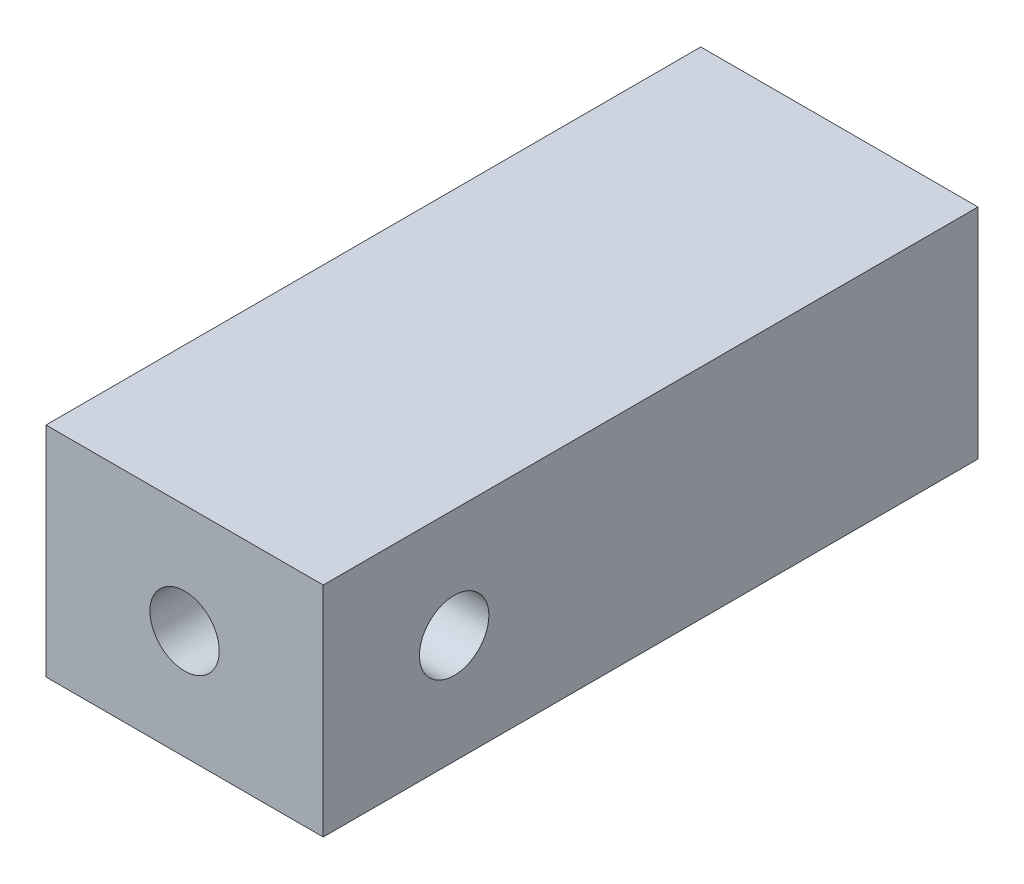
ISO-10303-21;
HEADER;
FILE_DESCRIPTION(('STEP AP214'),'2;1');
FILE_NAME('part.step','',(''),(''),'','','');
FILE_SCHEMA(('AUTOMOTIVE_DESIGN { 1 0 10303 214 1 1 1 1 }'));
ENDSEC;
DATA;
#1=APPLICATION_CONTEXT('core data for automotive mechanical design processes');
#2=APPLICATION_PROTOCOL_DEFINITION('international standard','automotive_design',2000,#1);
#3=PRODUCT_CONTEXT('',#1,'mechanical');
#4=PRODUCT('Part','Part','',(#3));
#5=PRODUCT_RELATED_PRODUCT_CATEGORY('part','',(#4));
#6=PRODUCT_DEFINITION_FORMATION('','',#4);
#7=PRODUCT_DEFINITION_CONTEXT('part definition',#1,'design');
#8=PRODUCT_DEFINITION('design','',#6,#7);
#9=PRODUCT_DEFINITION_SHAPE('','',#8);
#10=(LENGTH_UNIT() NAMED_UNIT(*) SI_UNIT(.MILLI.,.METRE.));
#11=(NAMED_UNIT(*) PLANE_ANGLE_UNIT() SI_UNIT($,.RADIAN.));
#12=(NAMED_UNIT(*) SI_UNIT($,.STERADIAN.) SOLID_ANGLE_UNIT());
#13=UNCERTAINTY_MEASURE_WITH_UNIT(LENGTH_MEASURE(1.E-05),#10,'distance_accuracy_value','');
#14=(GEOMETRIC_REPRESENTATION_CONTEXT(3) GLOBAL_UNCERTAINTY_ASSIGNED_CONTEXT((#13)) GLOBAL_UNIT_ASSIGNED_CONTEXT((#10,
#11,#12)) REPRESENTATION_CONTEXT('',''));
#15=CARTESIAN_POINT('',(0.,0.,0.));
#16=DIRECTION('',(0.,0.,1.));
#17=DIRECTION('',(1.,0.,0.));
#18=AXIS2_PLACEMENT_3D('',#15,#16,#17);
#19=CARTESIAN_POINT('',(6.35,-5.,30.));
#20=DIRECTION('',(0.,0.,-1.));
#21=DIRECTION('',(-1.,0.,0.));
#22=AXIS2_PLACEMENT_3D('',#19,#20,#21);
#23=CYLINDRICAL_SURFACE('',#22,1.5875);
#24=CARTESIAN_POINT('',(6.35,-5.,30.));
#25=DIRECTION('',(0.,0.,1.));
#26=DIRECTION('',(1.,0.,0.));
#27=AXIS2_PLACEMENT_3D('',#24,#25,#26);
#28=CIRCLE('',#27,1.5875);
#29=CARTESIAN_POINT('',(7.9375,-5.,30.));
#30=VERTEX_POINT('',#29);
#31=EDGE_CURVE('E109',#30,#30,#28,.T.);
#32=ORIENTED_EDGE('',*,*,#31,.T.);
#33=EDGE_LOOP('',(#32));
#34=FACE_BOUND('',#33,.T.);
#35=CARTESIAN_POINT('',(4.7625,-5.,25.59));
#36=CARTESIAN_POINT('',(4.76250389703763,-4.92915095463068,25.5899961041174));
#37=CARTESIAN_POINT('',(4.76728292998993,-4.8582724745346,25.5852245222981));
#38=CARTESIAN_POINT('',(4.78598948460399,-4.71896218896479,25.5665479150457));
#39=CARTESIAN_POINT('',(4.79992534555615,-4.65053267376699,25.5526345640368));
#40=CARTESIAN_POINT('',(4.83573406979614,-4.51853897435407,25.5168862810767));
#41=CARTESIAN_POINT('',(4.85755390135628,-4.45494564000333,25.4951042780132));
#42=CARTESIAN_POINT('',(4.90779541217916,-4.33325802593571,25.444955185947));
#43=CARTESIAN_POINT('',(4.93621961103376,-4.2751658568705,25.4165855837522));
#44=CARTESIAN_POINT('',(5.01109232259305,-4.1424303352103,25.3418679580117));
#45=CARTESIAN_POINT('',(5.06015826050958,-4.07073343195065,25.2929121462295));
#46=CARTESIAN_POINT('',(5.16581810092278,-3.93933386298857,25.1875249039839));
#47=CARTESIAN_POINT('',(5.22243059872736,-3.87966177019214,25.1310750089729));
#48=CARTESIAN_POINT('',(5.3638475045652,-3.75099943189347,24.9901493450863));
#49=CARTESIAN_POINT('',(5.45108806700432,-3.68732903691505,24.9032773129519));
#50=CARTESIAN_POINT('',(5.63159195837188,-3.58047384575442,24.7238363647634));
#51=CARTESIAN_POINT('',(5.72485213848059,-3.53727843635106,24.631270428323));
#52=CARTESIAN_POINT('',(5.87874884760696,-3.48278192091248,24.4795076017762));
#53=CARTESIAN_POINT('',(5.93819228697424,-3.46560182660029,24.4211162235734));
#54=CARTESIAN_POINT('',(6.04414793188666,-3.44153429900365,24.3183497685898));
#55=CARTESIAN_POINT('',(6.09032500204818,-3.43316429591458,24.2739873195653));
#56=CARTESIAN_POINT('',(6.16694912072186,-3.4228055111682,24.2032463051671));
#57=CARTESIAN_POINT('',(6.19679543375644,-3.41960077192013,24.1763669792003));
#58=CARTESIAN_POINT('',(6.24632844484815,-3.41578165501934,24.1362414072852));
#59=CARTESIAN_POINT('',(6.26503985662945,-3.41464449463582,24.1219972643188));
#60=CARTESIAN_POINT('',(6.29139356069688,-3.41357072498031,24.106568084902));
#61=CARTESIAN_POINT('',(6.29767280763601,-3.41334946859378,24.1031953775844));
#62=CARTESIAN_POINT('',(6.31061053140759,-3.4129755237362,24.0972714585057));
#63=CARTESIAN_POINT('',(6.31726794386282,-3.41282265261238,24.0947180636387));
#64=CARTESIAN_POINT('',(6.32924382424091,-3.41262745018344,24.0913815762441));
#65=CARTESIAN_POINT('',(6.33447964678338,-3.41256701631529,24.0903151762636));
#66=CARTESIAN_POINT('',(6.3450523130851,-3.41249895916934,24.0891115410369));
#67=CARTESIAN_POINT('',(6.35038889709763,-3.41249121487267,24.0889721765666));
#68=CARTESIAN_POINT('',(6.3609913844419,-3.41252918062127,24.0896461627449));
#69=CARTESIAN_POINT('',(6.36625735836957,-3.41257483250607,24.0904584768029));
#70=CARTESIAN_POINT('',(6.37660736872048,-3.41271453254082,24.0928783459675));
#71=CARTESIAN_POINT('',(6.38169089043472,-3.41280870760875,24.0944879861439));
#72=CARTESIAN_POINT('',(6.3995585626366,-3.41322093162997,24.1012651123531));
#73=CARTESIAN_POINT('',(6.41170607871695,-3.41365659664847,24.1080148901173));
#74=CARTESIAN_POINT('',(6.43512272603368,-3.41474029133559,24.1229261419796));
#75=CARTESIAN_POINT('',(6.44638173177858,-3.41539042409585,24.1311012022732));
#76=CARTESIAN_POINT('',(6.48215667628322,-3.41781498959904,24.1585835372783));
#77=CARTESIAN_POINT('',(6.50573114303392,-3.41998163401508,24.179082233108));
#78=CARTESIAN_POINT('',(6.55217165871214,-3.42525521262572,24.2207545975411));
#79=CARTESIAN_POINT('',(6.57503632429614,-3.42836386966622,24.2419294387249));
#80=CARTESIAN_POINT('',(6.62028726693252,-3.435511206545,24.284492907049));
#81=CARTESIAN_POINT('',(6.64267490128022,-3.43954670281683,24.3058805679654));
#82=CARTESIAN_POINT('',(6.68717462847129,-3.44855442806553,24.3487074141555));
#83=CARTESIAN_POINT('',(6.70928689228526,-3.45352604138479,24.3701465564739));
#84=CARTESIAN_POINT('',(6.78608550009062,-3.47252655686299,24.4449163613746));
#85=CARTESIAN_POINT('',(6.84024233962711,-3.48901792855836,24.4981938475657));
#86=CARTESIAN_POINT('',(6.94730576592902,-3.52805329026723,24.6038659957627));
#87=CARTESIAN_POINT('',(7.00021131693618,-3.55060211585807,24.6562599167633));
#88=CARTESIAN_POINT('',(7.10442268177438,-3.60200814402343,24.7596396798864));
#89=CARTESIAN_POINT('',(7.15572728070053,-3.63087001040755,24.8106244494554));
#90=CARTESIAN_POINT('',(7.25614320717116,-3.69515832935082,24.9105017991057));
#91=CARTESIAN_POINT('',(7.30525605966303,-3.73058012647956,24.9593958328317));
#92=CARTESIAN_POINT('',(7.41380317841809,-3.81904978547134,25.067516517824));
#93=CARTESIAN_POINT('',(7.47235944615251,-3.87426579346885,25.1258848173238));
#94=CARTESIAN_POINT('',(7.58285819765357,-3.99651488621904,25.2360688545125));
#95=CARTESIAN_POINT('',(7.63481296426858,-4.06352545457417,25.2878967600874));
#96=CARTESIAN_POINT('',(7.71959750298707,-4.19433221202803,25.3724922096134));
#97=CARTESIAN_POINT('',(7.754155898931,-4.25588212986962,25.4069804147871));
#98=CARTESIAN_POINT('',(7.81576421751242,-4.38611066696606,25.4684702416124));
#99=CARTESIAN_POINT('',(7.84282247543135,-4.45478125504101,25.4954801742071));
#100=CARTESIAN_POINT('',(7.8840986770727,-4.58682976384966,25.5366851604994));
#101=CARTESIAN_POINT('',(7.89966041758163,-4.64936511114957,25.5522212210114));
#102=CARTESIAN_POINT('',(7.92313538051704,-4.77724896820915,25.575658028009));
#103=CARTESIAN_POINT('',(7.93105316643102,-4.84259577513695,25.5835633301035));
#104=CARTESIAN_POINT('',(7.93866966368224,-4.974422795267,25.5911678112274));
#105=CARTESIAN_POINT('',(7.93834705046067,-5.04090550410264,25.5908456993009));
#106=CARTESIAN_POINT('',(7.92945561352854,-5.17275610471175,25.5819683069074));
#107=CARTESIAN_POINT('',(7.92088531653321,-5.23812379518618,25.5734115554857));
#108=CARTESIAN_POINT('',(7.89658340350374,-5.36355629632184,25.5491492876934));
#109=CARTESIAN_POINT('',(7.88112202006543,-5.42372739329241,25.533713532124));
#110=CARTESIAN_POINT('',(7.84404260456592,-5.54012114191816,25.4966983220834));
#111=CARTESIAN_POINT('',(7.82242227643246,-5.59634231126625,25.4751165763705));
#112=CARTESIAN_POINT('',(7.76415357324816,-5.72611043252649,25.4169578966849));
#113=CARTESIAN_POINT('',(7.72497076749532,-5.79738938522647,25.3778535146799));
#114=CARTESIAN_POINT('',(7.63894914210549,-5.93008155127175,25.2920236892132));
#115=CARTESIAN_POINT('',(7.59209307089512,-5.99147190080864,25.2452810734599));
#116=CARTESIAN_POINT('',(7.47406206633548,-6.12577655790253,25.1275786779146));
#117=CARTESIAN_POINT('',(7.40038234852918,-6.19429799787781,25.0541363341209));
#118=CARTESIAN_POINT('',(7.2462766687811,-6.31391724261018,24.9006670632283));
#119=CARTESIAN_POINT('',(7.16584621111663,-6.36500331954824,24.8206357488269));
#120=CARTESIAN_POINT('',(7.02516490235041,-6.43825924650051,24.6809890060884));
#121=CARTESIAN_POINT('',(6.96600174427972,-6.46451165962647,24.6223561221985));
#122=CARTESIAN_POINT('',(6.84609171491893,-6.50935335647387,24.503932871894));
#123=CARTESIAN_POINT('',(6.78534689430675,-6.52795208412478,24.444144027828));
#124=CARTESIAN_POINT('',(6.67595215546088,-6.55445711664319,24.3377383050935));
#125=CARTESIAN_POINT('',(6.62761485242384,-6.56382116181605,24.2911474223788));
#126=CARTESIAN_POINT('',(6.54688426259295,-6.57557031647108,24.2157342244597));
#127=CARTESIAN_POINT('',(6.51503558337731,-6.57925450184842,24.1865700906555));
#128=CARTESIAN_POINT('',(6.46984714303711,-6.58301361758644,24.14922980039));
#129=CARTESIAN_POINT('',(6.45776926980213,-6.58388631147932,24.1396128115334));
#130=CARTESIAN_POINT('',(6.43284717171285,-6.58538653278594,24.1213654568353));
#131=CARTESIAN_POINT('',(6.4200048895595,-6.58601465347181,24.1127327398689));
#132=CARTESIAN_POINT('',(6.40068493010964,-6.58670076694983,24.1024244157426));
#133=CARTESIAN_POINT('',(6.39483701987773,-6.58687811379084,24.0996181229455));
#134=CARTESIAN_POINT('',(6.38281654443958,-6.58717212593333,24.094817152759));
#135=CARTESIAN_POINT('',(6.37664496738506,-6.58728896529905,24.0928201508955));
#136=CARTESIAN_POINT('',(6.36521291734318,-6.58743533486871,24.0902799251889));
#137=CARTESIAN_POINT('',(6.35999983699544,-6.58747716656613,24.0895336985998));
#138=CARTESIAN_POINT('',(6.34953103350799,-6.58750852833345,24.0889763646493));
#139=CARTESIAN_POINT('',(6.34427541354027,-6.58749816039454,24.0891634337448));
#140=CARTESIAN_POINT('',(6.33275100515763,-6.58741892939597,24.0905625702224));
#141=CARTESIAN_POINT('',(6.32650926475277,-6.58733788570576,24.0919878234316));
#142=CARTESIAN_POINT('',(6.31432209110947,-6.58711073893729,24.095831062238));
#143=CARTESIAN_POINT('',(6.30837858645921,-6.58696426123489,24.0982547578288));
#144=CARTESIAN_POINT('',(6.28049907987245,-6.58613412602315,24.1112492729268));
#145=CARTESIAN_POINT('',(6.26049984463202,-6.58509669565302,24.125592999797));
#146=CARTESIAN_POINT('',(6.22174065838665,-6.58242686910014,24.1558231799466));
#147=CARTESIAN_POINT('',(6.20299961486411,-6.58078710277025,24.1717268738095));
#148=CARTESIAN_POINT('',(6.14829686605957,-6.5750579236933,24.2197670932311));
#149=CARTESIAN_POINT('',(6.11312263339979,-6.57012983628092,24.2527940262501));
#150=CARTESIAN_POINT('',(6.04343969943363,-6.55801665434634,24.3191321916899));
#151=CARTESIAN_POINT('',(6.0089319928307,-6.55082842724322,24.3524437558927));
#152=CARTESIAN_POINT('',(5.9406404811646,-6.53421347590636,24.4188645958818));
#153=CARTESIAN_POINT('',(5.90685361292447,-6.52480016051365,24.451973909564));
#154=CARTESIAN_POINT('',(5.83977058619284,-6.5036812383225,24.5179232060884));
#155=CARTESIAN_POINT('',(5.80647427532257,-6.4919763601989,24.5507632710973));
#156=CARTESIAN_POINT('',(5.72307594319569,-6.45946699961953,24.6331787805833));
#157=CARTESIAN_POINT('',(5.67331311550503,-6.43710873167583,24.682503520289));
#158=CARTESIAN_POINT('',(5.57531984537415,-6.38674656366913,24.7797691241432));
#159=CARTESIAN_POINT('',(5.52709021305381,-6.35873973454896,24.8277092554988));
#160=CARTESIAN_POINT('',(5.38529147345793,-6.26580426408146,24.968767214804));
#161=CARTESIAN_POINT('',(5.29450541195571,-6.19192068042418,25.0592288449138));
#162=CARTESIAN_POINT('',(5.15932188446301,-6.05253436775264,25.1940037203534));
#163=CARTESIAN_POINT('',(5.11069215943519,-5.99510263047811,25.2425049164081));
#164=CARTESIAN_POINT('',(5.02019516199023,-5.87044959859834,25.3327843789538));
#165=CARTESIAN_POINT('',(4.97831590058573,-5.80324607202412,25.3745745638605));
#166=CARTESIAN_POINT('',(4.91040268104391,-5.67240155476057,25.4423524755451));
#167=CARTESIAN_POINT('',(4.88287275967468,-5.61031648762995,25.4698313292858));
#168=CARTESIAN_POINT('',(4.83542077259719,-5.48057837025857,25.5171987106552));
#169=CARTESIAN_POINT('',(4.81548895770586,-5.41293259148685,25.537096964983));
#170=CARTESIAN_POINT('',(4.78777549690456,-5.28782560684921,25.5647647333207));
#171=CARTESIAN_POINT('',(4.77834738918193,-5.23109030325961,25.5741777395298));
#172=CARTESIAN_POINT('',(4.76570830798837,-5.1162431929504,25.5867967055685));
#173=CARTESIAN_POINT('',(4.76249680248817,-5.05813150445546,25.5900031965641));
#174=CARTESIAN_POINT('',(4.7625,-5.,25.59));
#175=B_SPLINE_CURVE_WITH_KNOTS('',3,(#35,#36,#37,#38,#39,#40,#41,#42,#43,#44,#45,#46,#47,#48,
#49,#50,#51,#52,#53,#54,#55,#56,#57,#58,#59,#60,#61,#62,#63,#64,#65,#66,#67,#68,#69,#70,#71,#72,
#73,#74,#75,#76,#77,#78,#79,#80,#81,#82,#83,#84,#85,#86,#87,#88,#89,#90,#91,#92,#93,#94,#95,#96,
#97,#98,#99,#100,#101,#102,#103,#104,#105,#106,#107,#108,#109,#110,#111,#112,#113,#114,#115,
#116,#117,#118,#119,#120,#121,#122,#123,#124,#125,#126,#127,#128,#129,#130,#131,#132,#133,#134,
#135,#136,#137,#138,#139,#140,#141,#142,#143,#144,#145,#146,#147,#148,#149,#150,#151,#152,#153,
#154,#155,#156,#157,#158,#159,#160,#161,#162,#163,#164,#165,#166,#167,#168,#169,#170,#171,#172,
#173,#174),.UNSPECIFIED.,.T.,.F.,(4,2,2,2,2,2,2,2,2,2,2,2,2,2,2,2,2,2,2,2,2,2,2,2,2,2,2,2,2,2,2,
2,2,2,2,2,2,2,2,2,2,2,2,2,2,2,2,2,2,2,2,2,2,2,2,2,2,2,2,2,2,2,2,2,2,2,2,2,2,4),(0.,
0.212292256511526,0.424778119928417,0.635860517852925,0.847023577143529,1.14453982942337,
1.44280322491309,1.8564050835252,2.2697923162809,2.52477021052349,2.71831419584283,
2.8392194047191,2.90952794768359,2.93088745273038,2.95218956217326,2.96815232904023,
2.9840784197725,2.99998717954843,3.01593776336173,3.05730427624332,3.09908912960614,
3.19288089005881,3.28684523218849,3.38049152284374,3.4740764387586,3.7070282623813,
3.94016660352504,4.17347776272342,4.40662397653399,4.70391650697207,5.00064752818204,
5.23546971891959,5.47002988391914,5.66804141198609,5.86593465272642,6.06434005465023,
6.26278090433548,6.45404426495234,6.64537902262273,6.91463149386278,7.18449784451944,
7.55619729901187,7.92814628498145,8.18981072212397,8.45115131474451,8.65440522578264,
8.78427341310193,8.8306634521696,8.87694024916764,8.89637057070647,8.91574468135097,
8.93146888443177,8.94716237643337,8.96625420847888,8.98545677493515,9.05855802030898,
9.13258526151245,9.27786584121137,9.42334867582738,9.56797619980672,9.71255780936788,
9.93292429705593,10.1534053507879,10.5939045661397,10.8617010647503,11.1290165812034,
11.3479597336018,11.5666210052883,11.740821299509,11.9150066846603),.UNSPECIFIED.);
#176=CARTESIAN_POINT('',(4.7625,-5.,25.59));
#177=VERTEX_POINT('',#176);
#178=EDGE_CURVE('E37',#177,#177,#175,.T.);
#179=ORIENTED_EDGE('',*,*,#178,.T.);
#180=EDGE_LOOP('',(#179));
#181=FACE_BOUND('',#180,.T.);
#182=ADVANCED_FACE('F33',(#34,#181),#23,.F.);
#183=CARTESIAN_POINT('',(6.35,-5.,0.));
#184=DIRECTION('',(0.,0.,1.));
#185=DIRECTION('',(1.,0.,0.));
#186=AXIS2_PLACEMENT_3D('',#183,#184,#185);
#187=CIRCLE('',#186,1.5875);
#188=CARTESIAN_POINT('',(7.9375,-5.,0.));
#189=VERTEX_POINT('',#188);
#190=EDGE_CURVE('E149',#189,#189,#187,.T.);
#191=ORIENTED_EDGE('',*,*,#190,.F.);
#192=EDGE_LOOP('',(#191));
#193=FACE_BOUND('',#192,.T.);
#194=CARTESIAN_POINT('',(4.7625,-5.,22.41));
#195=CARTESIAN_POINT('',(4.76250389703763,-5.07084904536932,22.4100038958826));
#196=CARTESIAN_POINT('',(4.76728292998993,-5.1417275254654,22.4147754777019));
#197=CARTESIAN_POINT('',(4.78598948460399,-5.28103781103521,22.4334520849544));
#198=CARTESIAN_POINT('',(4.79992534555615,-5.34946732623301,22.4473654359632));
#199=CARTESIAN_POINT('',(4.83573406979614,-5.48146102564593,22.4831137189233));
#200=CARTESIAN_POINT('',(4.85755390135628,-5.54505435999667,22.5048957219868));
#201=CARTESIAN_POINT('',(4.90779541217916,-5.66674197406429,22.555044814053));
#202=CARTESIAN_POINT('',(4.93621961103376,-5.7248341431295,22.5834144162478));
#203=CARTESIAN_POINT('',(5.01109232259305,-5.8575696647897,22.6581320419883));
#204=CARTESIAN_POINT('',(5.06015826050958,-5.92926656804935,22.7070878537705));
#205=CARTESIAN_POINT('',(5.16581810092278,-6.06066613701143,22.8124750960161));
#206=CARTESIAN_POINT('',(5.22243059872736,-6.12033822980786,22.8689249910271));
#207=CARTESIAN_POINT('',(5.3638475045652,-6.24900056810653,23.0098506549137));
#208=CARTESIAN_POINT('',(5.45108806700432,-6.31267096308495,23.0967226870481));
#209=CARTESIAN_POINT('',(5.63159195837189,-6.41952615424558,23.2761636352366));
#210=CARTESIAN_POINT('',(5.72485213848059,-6.46272156364894,23.368729571677));
#211=CARTESIAN_POINT('',(5.87874884760696,-6.51721807908752,23.5204923982238));
#212=CARTESIAN_POINT('',(5.93819228697424,-6.53439817339971,23.5788837764266));
#213=CARTESIAN_POINT('',(6.04414793188666,-6.55846570099635,23.6816502314102));
#214=CARTESIAN_POINT('',(6.09032500204818,-6.56683570408542,23.7260126804347));
#215=CARTESIAN_POINT('',(6.16694912072186,-6.5771944888318,23.7967536948329));
#216=CARTESIAN_POINT('',(6.19679543375643,-6.58039922807987,23.8236330207997));
#217=CARTESIAN_POINT('',(6.24632844484815,-6.58421834498066,23.8637585927148));
#218=CARTESIAN_POINT('',(6.26503985662945,-6.58535550536418,23.8780027356812));
#219=CARTESIAN_POINT('',(6.29139356069688,-6.58642927501969,23.893431915098));
#220=CARTESIAN_POINT('',(6.29767280763601,-6.58665053140622,23.8968046224156));
#221=CARTESIAN_POINT('',(6.31061053140759,-6.5870244762638,23.9027285414943));
#222=CARTESIAN_POINT('',(6.31726794386281,-6.58717734738762,23.9052819363613));
#223=CARTESIAN_POINT('',(6.32924382424091,-6.58737254981656,23.9086184237559));
#224=CARTESIAN_POINT('',(6.33447964678338,-6.58743298368471,23.9096848237364));
#225=CARTESIAN_POINT('',(6.34505231308509,-6.58750104083066,23.9108884589631));
#226=CARTESIAN_POINT('',(6.35038889709763,-6.58750878512732,23.9110278234334));
#227=CARTESIAN_POINT('',(6.3609913844419,-6.58747081937873,23.9103538372551));
#228=CARTESIAN_POINT('',(6.36625735836957,-6.58742516749393,23.9095415231971));
#229=CARTESIAN_POINT('',(6.37660736872048,-6.58728546745918,23.9071216540325));
#230=CARTESIAN_POINT('',(6.38169089043471,-6.58719129239125,23.9055120138561));
#231=CARTESIAN_POINT('',(6.3995585626366,-6.58677906837003,23.8987348876469));
#232=CARTESIAN_POINT('',(6.41170607871694,-6.58634340335153,23.8919851098827));
#233=CARTESIAN_POINT('',(6.43512272603367,-6.58525970866441,23.8770738580204));
#234=CARTESIAN_POINT('',(6.44638173177857,-6.58460957590415,23.8688987977268));
#235=CARTESIAN_POINT('',(6.48215667628321,-6.58218501040096,23.8414164627217));
#236=CARTESIAN_POINT('',(6.5057311430339,-6.58001836598492,23.820917766892));
#237=CARTESIAN_POINT('',(6.55217165871211,-6.57474478737428,23.7792454024589));
#238=CARTESIAN_POINT('',(6.5750363242961,-6.57163613033379,23.7580705612751));
#239=CARTESIAN_POINT('',(6.62028726693247,-6.56448879345501,23.7155070929511));
#240=CARTESIAN_POINT('',(6.64267490128016,-6.56045329718318,23.6941194320347));
#241=CARTESIAN_POINT('',(6.68717462847123,-6.55144557193448,23.6512925858446));
#242=CARTESIAN_POINT('',(6.70928689228519,-6.54647395861523,23.6298534435262));
#243=CARTESIAN_POINT('',(6.78608550009054,-6.52747344313704,23.5550836386254));
#244=CARTESIAN_POINT('',(6.84024233962704,-6.51098207144166,23.5018061524344));
#245=CARTESIAN_POINT('',(6.94730576592896,-6.47194670973279,23.3961340042373));
#246=CARTESIAN_POINT('',(7.00021131693612,-6.44939788414196,23.3437400832368));
#247=CARTESIAN_POINT('',(7.10442268177433,-6.3979918559766,23.2403603201137));
#248=CARTESIAN_POINT('',(7.15572728070048,-6.36912998959248,23.1893755505446));
#249=CARTESIAN_POINT('',(7.25614320717112,-6.30484167064921,23.0894982008943));
#250=CARTESIAN_POINT('',(7.30525605966299,-6.26941987352046,23.0406041671684));
#251=CARTESIAN_POINT('',(7.41380317841806,-6.18095021452869,22.9324834821761));
#252=CARTESIAN_POINT('',(7.47235944615249,-6.12573420653118,22.8741151826763));
#253=CARTESIAN_POINT('',(7.58285819765355,-6.00348511378098,22.7639311454875));
#254=CARTESIAN_POINT('',(7.63481296426856,-5.93647454542585,22.7121032399126));
#255=CARTESIAN_POINT('',(7.71959750298705,-5.805667787972,22.6275077903867));
#256=CARTESIAN_POINT('',(7.75415589893098,-5.74411787013041,22.5930195852129));
#257=CARTESIAN_POINT('',(7.8157642175124,-5.61388933303397,22.5315297583876));
#258=CARTESIAN_POINT('',(7.84282247543134,-5.54521874495901,22.504519825793));
#259=CARTESIAN_POINT('',(7.88409867707269,-5.41317023615037,22.4633148395006));
#260=CARTESIAN_POINT('',(7.89966041758162,-5.35063488885046,22.4477787789886));
#261=CARTESIAN_POINT('',(7.92313538051704,-5.22275103179088,22.424341971991));
#262=CARTESIAN_POINT('',(7.93105316643102,-5.15740422486308,22.4164366698965));
#263=CARTESIAN_POINT('',(7.93866966368224,-5.02557720473303,22.4088321887726));
#264=CARTESIAN_POINT('',(7.93834705046067,-4.95909449589739,22.4091543006991));
#265=CARTESIAN_POINT('',(7.92945561352854,-4.82724389528827,22.4180316930926));
#266=CARTESIAN_POINT('',(7.92088531653321,-4.76187620481385,22.4265884445143));
#267=CARTESIAN_POINT('',(7.89658340350375,-4.63644370367818,22.4508507123066));
#268=CARTESIAN_POINT('',(7.88112202006544,-4.57627260670762,22.466286467876));
#269=CARTESIAN_POINT('',(7.84404260456593,-4.45987885808186,22.5033016779166));
#270=CARTESIAN_POINT('',(7.82242227643247,-4.40365768873377,22.5248834236294));
#271=CARTESIAN_POINT('',(7.76415357324817,-4.27388956747353,22.5830421033151));
#272=CARTESIAN_POINT('',(7.72497076749533,-4.20261061477355,22.6221464853201));
#273=CARTESIAN_POINT('',(7.6389491421055,-4.06991844872827,22.7079763107868));
#274=CARTESIAN_POINT('',(7.59209307089514,-4.00852809919139,22.7547189265401));
#275=CARTESIAN_POINT('',(7.4740620663355,-3.8742234420975,22.8724213220853));
#276=CARTESIAN_POINT('',(7.40038234852921,-3.80570200212221,22.9458636658791));
#277=CARTESIAN_POINT('',(7.24627666878112,-3.68608275738984,23.0993329367717));
#278=CARTESIAN_POINT('',(7.16584621111666,-3.63499668045178,23.179364251173));
#279=CARTESIAN_POINT('',(7.02516490235044,-3.56174075349951,23.3190109939116));
#280=CARTESIAN_POINT('',(6.96600174427975,-3.53548834037354,23.3776438778015));
#281=CARTESIAN_POINT('',(6.84609171491895,-3.49064664352614,23.496067128106));
#282=CARTESIAN_POINT('',(6.78534689430677,-3.47204791587522,23.555855972172));
#283=CARTESIAN_POINT('',(6.6759521554609,-3.44554288335682,23.6622616949065));
#284=CARTESIAN_POINT('',(6.62761485242386,-3.43617883818395,23.7088525776212));
#285=CARTESIAN_POINT('',(6.54688426259297,-3.42442968352893,23.7842657755403));
#286=CARTESIAN_POINT('',(6.51503558337732,-3.42074549815158,23.8134299093445));
#287=CARTESIAN_POINT('',(6.46984714303712,-3.41698638241357,23.85077019961));
#288=CARTESIAN_POINT('',(6.45776926980214,-3.41611368852068,23.8603871884666));
#289=CARTESIAN_POINT('',(6.43284717171285,-3.41461346721406,23.8786345431647));
#290=CARTESIAN_POINT('',(6.4200048895595,-3.41398534652819,23.8872672601311));
#291=CARTESIAN_POINT('',(6.40068493010964,-3.41329923305017,23.8975755842574));
#292=CARTESIAN_POINT('',(6.39483701987772,-3.41312188620916,23.9003818770545));
#293=CARTESIAN_POINT('',(6.38281654443958,-3.41282787406667,23.905182847241));
#294=CARTESIAN_POINT('',(6.37664496738506,-3.41271103470095,23.9071798491045));
#295=CARTESIAN_POINT('',(6.36521291734318,-3.41256466513129,23.9097200748111));
#296=CARTESIAN_POINT('',(6.35999983699544,-3.41252283343387,23.9104663014002));
#297=CARTESIAN_POINT('',(6.34953103350798,-3.41249147166656,23.9110236353507));
#298=CARTESIAN_POINT('',(6.34427541354027,-3.41250183960547,23.9108365662552));
#299=CARTESIAN_POINT('',(6.33275100515763,-3.41258107060403,23.9094374297776));
#300=CARTESIAN_POINT('',(6.32650926475276,-3.41266211429424,23.9080121765684));
#301=CARTESIAN_POINT('',(6.31432209110946,-3.41288926106271,23.904168937762));
#302=CARTESIAN_POINT('',(6.30837858645921,-3.41303573876511,23.9017452421712));
#303=CARTESIAN_POINT('',(6.28049907987244,-3.41386587397685,23.8887507270732));
#304=CARTESIAN_POINT('',(6.260499844632,-3.41490330434698,23.874407000203));
#305=CARTESIAN_POINT('',(6.22174065838662,-3.41757313089986,23.8441768200534));
#306=CARTESIAN_POINT('',(6.20299961486408,-3.41921289722976,23.8282731261904));
#307=CARTESIAN_POINT('',(6.14829686605952,-3.42494207630671,23.7802329067689));
#308=CARTESIAN_POINT('',(6.11312263339973,-3.42987016371909,23.7472059737499));
#309=CARTESIAN_POINT('',(6.04343969943354,-3.44198334565368,23.68086780831));
#310=CARTESIAN_POINT('',(6.0089319928306,-3.4491715727568,23.6475562441072));
#311=CARTESIAN_POINT('',(5.94064048116448,-3.46578652409367,23.5811354041181));
#312=CARTESIAN_POINT('',(5.90685361292433,-3.47519983948639,23.5480260904359));
#313=CARTESIAN_POINT('',(5.83977058619269,-3.49631876167756,23.4820767939115));
#314=CARTESIAN_POINT('',(5.80647427532241,-3.50802363980116,23.4492367289025));
#315=CARTESIAN_POINT('',(5.72307594319553,-3.54053300038054,23.3668212194165));
#316=CARTESIAN_POINT('',(5.67331311550487,-3.56289126832425,23.3174964797109));
#317=CARTESIAN_POINT('',(5.57531984537401,-3.61325343633095,23.2202308758567));
#318=CARTESIAN_POINT('',(5.52709021305367,-3.64126026545112,23.1722907445011));
#319=CARTESIAN_POINT('',(5.38529147345782,-3.73419573591862,23.0312327851959));
#320=CARTESIAN_POINT('',(5.29450541195562,-3.80807931957591,22.9407711550861));
#321=CARTESIAN_POINT('',(5.15932188446294,-3.94746563224744,22.8059962796465));
#322=CARTESIAN_POINT('',(5.11069215943512,-4.00489736952198,22.7574950835919));
#323=CARTESIAN_POINT('',(5.02019516199017,-4.12955040140174,22.6672156210462));
#324=CARTESIAN_POINT('',(4.97831590058567,-4.19675392797597,22.6254254361394));
#325=CARTESIAN_POINT('',(4.91040268104387,-4.32759844523952,22.5576475244549));
#326=CARTESIAN_POINT('',(4.88287275967464,-4.38968351237013,22.5301686707141));
#327=CARTESIAN_POINT('',(4.83542077259717,-4.51942162974151,22.4828012893447));
#328=CARTESIAN_POINT('',(4.81548895770584,-4.58706740851323,22.462903035017));
#329=CARTESIAN_POINT('',(4.78777549690454,-4.71217439315086,22.4352352666793));
#330=CARTESIAN_POINT('',(4.77834738918192,-4.76890969674044,22.4258222604702));
#331=CARTESIAN_POINT('',(4.76570830798837,-4.88375680704963,22.4132032944315));
#332=CARTESIAN_POINT('',(4.76249680248817,-4.94186849554456,22.4099968034359));
#333=CARTESIAN_POINT('',(4.7625,-5.,22.41));
#334=B_SPLINE_CURVE_WITH_KNOTS('',3,(#194,#195,#196,#197,#198,#199,#200,#201,#202,#203,#204,
#205,#206,#207,#208,#209,#210,#211,#212,#213,#214,#215,#216,#217,#218,#219,#220,#221,#222,#223,
#224,#225,#226,#227,#228,#229,#230,#231,#232,#233,#234,#235,#236,#237,#238,#239,#240,#241,#242,
#243,#244,#245,#246,#247,#248,#249,#250,#251,#252,#253,#254,#255,#256,#257,#258,#259,#260,#261,
#262,#263,#264,#265,#266,#267,#268,#269,#270,#271,#272,#273,#274,#275,#276,#277,#278,#279,#280,
#281,#282,#283,#284,#285,#286,#287,#288,#289,#290,#291,#292,#293,#294,#295,#296,#297,#298,#299,
#300,#301,#302,#303,#304,#305,#306,#307,#308,#309,#310,#311,#312,#313,#314,#315,#316,#317,#318,
#319,#320,#321,#322,#323,#324,#325,#326,#327,#328,#329,#330,#331,#332,#333),.UNSPECIFIED.,.T.,
.F.,(4,2,2,2,2,2,2,2,2,2,2,2,2,2,2,2,2,2,2,2,2,2,2,2,2,2,2,2,2,2,2,2,2,2,2,2,2,2,2,2,2,2,2,2,2,
2,2,2,2,2,2,2,2,2,2,2,2,2,2,2,2,2,2,2,2,2,2,2,2,4),(0.,0.212292256511525,0.424778119928417,
0.635860517852925,0.847023577143529,1.14453982942337,1.44280322491309,1.8564050835252,
2.2697923162809,2.52477021052349,2.71831419584283,2.8392194047191,2.90952794768359,
2.93088745273038,2.95218956217326,2.96815232904023,2.9840784197725,2.99998717954843,
3.01593776336173,3.05730427624332,3.09908912960612,3.19288089005877,3.28684523218843,
3.38049152284366,3.47407643875849,3.7070282623812,3.94016660352496,4.17347776272335,
4.40662397653394,4.70391650697203,5.000647528182,5.23546971891956,5.4700298839191,
5.66804141198606,5.86593465272639,6.0643400546502,6.26278090433546,6.4540442649523,
6.64537902262271,6.91463149386274,7.1844978445194,7.55619729901182,7.92814628498139,
8.18981072212392,8.45115131474449,8.65440522578261,8.78427341310191,8.83066345216959,
8.87694024916764,8.89637057070647,8.91574468135097,8.93146888443177,8.94716237643338,
8.96625420847888,8.98545677493516,9.05855802030901,9.13258526151251,9.27786584121148,
9.42334867582754,9.56797619980693,9.71255780936813,9.93292429705615,10.1534053507881,
10.5939045661399,10.8617010647504,11.1290165812035,11.3479597336019,11.5666210052883,
11.7408212995091,11.9150066846603),.UNSPECIFIED.);
#335=CARTESIAN_POINT('',(4.7625,-5.,22.41));
#336=VERTEX_POINT('',#335);
#337=EDGE_CURVE('E114',#336,#336,#334,.T.);
#338=ORIENTED_EDGE('',*,*,#337,.T.);
#339=EDGE_LOOP('',(#338));
#340=FACE_BOUND('',#339,.T.);
#341=ADVANCED_FACE('F135',(#193,#340),#23,.F.);
#342=CARTESIAN_POINT('',(0.,0.,30.));
#343=DIRECTION('',(0.,0.,1.));
#344=DIRECTION('',(1.,0.,0.));
#345=AXIS2_PLACEMENT_3D('',#342,#343,#344);
#346=PLANE('',#345);
#347=DIRECTION('',(0.,-1.,0.));
#348=VECTOR('',#347,1.);
#349=CARTESIAN_POINT('',(0.,0.,30.));
#350=LINE('',#349,#348);
#351=CARTESIAN_POINT('',(0.,0.,30.));
#352=VERTEX_POINT('',#351);
#353=CARTESIAN_POINT('',(0.,-10.,30.));
#354=VERTEX_POINT('',#353);
#355=EDGE_CURVE('E93',#352,#354,#350,.T.);
#356=ORIENTED_EDGE('',*,*,#355,.T.);
#357=DIRECTION('',(1.,0.,0.));
#358=VECTOR('',#357,1.);
#359=CARTESIAN_POINT('',(0.,-10.,30.));
#360=LINE('',#359,#358);
#361=CARTESIAN_POINT('',(12.7,-10.,30.));
#362=VERTEX_POINT('',#361);
#363=EDGE_CURVE('E87',#354,#362,#360,.T.);
#364=ORIENTED_EDGE('',*,*,#363,.T.);
#365=DIRECTION('',(0.,1.,0.));
#366=VECTOR('',#365,1.);
#367=CARTESIAN_POINT('',(12.7,0.,30.));
#368=LINE('',#367,#366);
#369=CARTESIAN_POINT('',(12.7,0.,30.));
#370=VERTEX_POINT('',#369);
#371=EDGE_CURVE('E91',#362,#370,#368,.T.);
#372=ORIENTED_EDGE('',*,*,#371,.T.);
#373=DIRECTION('',(-1.,0.,0.));
#374=VECTOR('',#373,1.);
#375=CARTESIAN_POINT('',(0.,0.,30.));
#376=LINE('',#375,#374);
#377=EDGE_CURVE('E57',#370,#352,#376,.T.);
#378=ORIENTED_EDGE('',*,*,#377,.T.);
#379=EDGE_LOOP('',(#356,#364,#372,#378));
#380=FACE_BOUND('',#379,.T.);
#381=ORIENTED_EDGE('',*,*,#31,.F.);
#382=EDGE_LOOP('',(#381));
#383=FACE_BOUND('',#382,.T.);
#384=ADVANCED_FACE('F88',(#380,#383),#346,.T.);
#385=CARTESIAN_POINT('',(0.,0.,0.));
#386=DIRECTION('',(0.,0.,1.));
#387=DIRECTION('',(1.,0.,0.));
#388=AXIS2_PLACEMENT_3D('',#385,#386,#387);
#389=PLANE('',#388);
#390=DIRECTION('',(0.,-1.,0.));
#391=VECTOR('',#390,1.);
#392=CARTESIAN_POINT('',(0.,0.,0.));
#393=LINE('',#392,#391);
#394=CARTESIAN_POINT('',(0.,0.,0.));
#395=VERTEX_POINT('',#394);
#396=CARTESIAN_POINT('',(0.,-10.,0.));
#397=VERTEX_POINT('',#396);
#398=EDGE_CURVE('E106',#395,#397,#393,.T.);
#399=ORIENTED_EDGE('',*,*,#398,.F.);
#400=DIRECTION('',(-1.,0.,0.));
#401=VECTOR('',#400,1.);
#402=CARTESIAN_POINT('',(0.,0.,0.));
#403=LINE('',#402,#401);
#404=CARTESIAN_POINT('',(12.7,0.,0.));
#405=VERTEX_POINT('',#404);
#406=EDGE_CURVE('E80',#405,#395,#403,.T.);
#407=ORIENTED_EDGE('',*,*,#406,.F.);
#408=DIRECTION('',(0.,1.,0.));
#409=VECTOR('',#408,1.);
#410=CARTESIAN_POINT('',(12.7,0.,0.));
#411=LINE('',#410,#409);
#412=CARTESIAN_POINT('',(12.7,-10.,0.));
#413=VERTEX_POINT('',#412);
#414=EDGE_CURVE('E74',#413,#405,#411,.T.);
#415=ORIENTED_EDGE('',*,*,#414,.F.);
#416=DIRECTION('',(1.,0.,0.));
#417=VECTOR('',#416,1.);
#418=CARTESIAN_POINT('',(0.,-10.,0.));
#419=LINE('',#418,#417);
#420=EDGE_CURVE('E97',#397,#413,#419,.T.);
#421=ORIENTED_EDGE('',*,*,#420,.F.);
#422=EDGE_LOOP('',(#399,#407,#415,#421));
#423=FACE_BOUND('',#422,.T.);
#424=ORIENTED_EDGE('',*,*,#190,.T.);
#425=EDGE_LOOP('',(#424));
#426=FACE_BOUND('',#425,.T.);
#427=ADVANCED_FACE('F161',(#423,#426),#389,.F.);
#428=CARTESIAN_POINT('',(0.,0.,30.));
#429=DIRECTION('',(1.,0.,0.));
#430=DIRECTION('',(0.,0.,-1.));
#431=AXIS2_PLACEMENT_3D('',#428,#429,#430);
#432=PLANE('',#431);
#433=CARTESIAN_POINT('',(0.,-5.,24.));
#434=DIRECTION('',(1.,0.,0.));
#435=DIRECTION('',(0.,0.,-1.));
#436=AXIS2_PLACEMENT_3D('',#433,#434,#435);
#437=CIRCLE('',#436,1.59);
#438=CARTESIAN_POINT('',(0.,-5.,22.41));
#439=VERTEX_POINT('',#438);
#440=EDGE_CURVE('E119',#439,#439,#437,.T.);
#441=ORIENTED_EDGE('',*,*,#440,.T.);
#442=EDGE_LOOP('',(#441));
#443=FACE_BOUND('',#442,.T.);
#444=ORIENTED_EDGE('',*,*,#398,.T.);
#445=DIRECTION('',(0.,0.,-1.));
#446=VECTOR('',#445,1.);
#447=CARTESIAN_POINT('',(0.,-10.,30.));
#448=LINE('',#447,#446);
#449=EDGE_CURVE('E11',#354,#397,#448,.T.);
#450=ORIENTED_EDGE('',*,*,#449,.F.);
#451=ORIENTED_EDGE('',*,*,#355,.F.);
#452=DIRECTION('',(0.,0.,-1.));
#453=VECTOR('',#452,1.);
#454=CARTESIAN_POINT('',(0.,0.,30.));
#455=LINE('',#454,#453);
#456=EDGE_CURVE('E102',#352,#395,#455,.T.);
#457=ORIENTED_EDGE('',*,*,#456,.T.);
#458=EDGE_LOOP('',(#444,#450,#451,#457));
#459=FACE_BOUND('',#458,.T.);
#460=ADVANCED_FACE('F35',(#443,#459),#432,.F.);
#461=CARTESIAN_POINT('',(0.,-10.,30.));
#462=DIRECTION('',(0.,1.,0.));
#463=DIRECTION('',(0.,0.,1.));
#464=AXIS2_PLACEMENT_3D('',#461,#462,#463);
#465=PLANE('',#464);
#466=ORIENTED_EDGE('',*,*,#420,.T.);
#467=DIRECTION('',(0.,0.,-1.));
#468=VECTOR('',#467,1.);
#469=CARTESIAN_POINT('',(12.7,-10.,30.));
#470=LINE('',#469,#468);
#471=EDGE_CURVE('E48',#362,#413,#470,.T.);
#472=ORIENTED_EDGE('',*,*,#471,.F.);
#473=ORIENTED_EDGE('',*,*,#363,.F.);
#474=ORIENTED_EDGE('',*,*,#449,.T.);
#475=EDGE_LOOP('',(#466,#472,#473,#474));
#476=FACE_BOUND('',#475,.T.);
#477=ADVANCED_FACE('F96',(#476),#465,.F.);
#478=CARTESIAN_POINT('',(12.7,0.,30.));
#479=DIRECTION('',(-1.,0.,0.));
#480=DIRECTION('',(0.,-1.,0.));
#481=AXIS2_PLACEMENT_3D('',#478,#479,#480);
#482=PLANE('',#481);
#483=CARTESIAN_POINT('',(12.7,-5.,24.));
#484=DIRECTION('',(-1.,0.,0.));
#485=DIRECTION('',(0.,-1.,0.));
#486=AXIS2_PLACEMENT_3D('',#483,#484,#485);
#487=CIRCLE('',#486,1.59);
#488=CARTESIAN_POINT('',(12.7,-6.59,24.));
#489=VERTEX_POINT('',#488);
#490=EDGE_CURVE('E147',#489,#489,#487,.F.);
#491=ORIENTED_EDGE('',*,*,#490,.F.);
#492=EDGE_LOOP('',(#491));
#493=FACE_BOUND('',#492,.T.);
#494=ORIENTED_EDGE('',*,*,#414,.T.);
#495=DIRECTION('',(0.,0.,-1.));
#496=VECTOR('',#495,1.);
#497=CARTESIAN_POINT('',(12.7,0.,30.));
#498=LINE('',#497,#496);
#499=EDGE_CURVE('E98',#370,#405,#498,.T.);
#500=ORIENTED_EDGE('',*,*,#499,.F.);
#501=ORIENTED_EDGE('',*,*,#371,.F.);
#502=ORIENTED_EDGE('',*,*,#471,.T.);
#503=EDGE_LOOP('',(#494,#500,#501,#502));
#504=FACE_BOUND('',#503,.T.);
#505=ADVANCED_FACE('F100',(#493,#504),#482,.F.);
#506=CARTESIAN_POINT('',(0.,0.,30.));
#507=DIRECTION('',(0.,-1.,0.));
#508=DIRECTION('',(0.,0.,-1.));
#509=AXIS2_PLACEMENT_3D('',#506,#507,#508);
#510=PLANE('',#509);
#511=ORIENTED_EDGE('',*,*,#406,.T.);
#512=ORIENTED_EDGE('',*,*,#456,.F.);
#513=ORIENTED_EDGE('',*,*,#377,.F.);
#514=ORIENTED_EDGE('',*,*,#499,.T.);
#515=EDGE_LOOP('',(#511,#512,#513,#514));
#516=FACE_BOUND('',#515,.T.);
#517=ADVANCED_FACE('F125',(#516),#510,.F.);
#518=CARTESIAN_POINT('',(30.,-5.,24.));
#519=DIRECTION('',(-1.,0.,0.));
#520=DIRECTION('',(0.,0.,1.));
#521=AXIS2_PLACEMENT_3D('',#518,#519,#520);
#522=CYLINDRICAL_SURFACE('',#521,1.59);
#523=ORIENTED_EDGE('',*,*,#440,.F.);
#524=EDGE_LOOP('',(#523));
#525=FACE_BOUND('',#524,.T.);
#526=ORIENTED_EDGE('',*,*,#337,.F.);
#527=EDGE_LOOP('',(#526));
#528=FACE_BOUND('',#527,.T.);
#529=ORIENTED_EDGE('',*,*,#178,.F.);
#530=EDGE_LOOP('',(#529));
#531=FACE_BOUND('',#530,.T.);
#532=ORIENTED_EDGE('',*,*,#490,.T.);
#533=EDGE_LOOP('',(#532));
#534=FACE_BOUND('',#533,.T.);
#535=ADVANCED_FACE('F122',(#525,#528,#531,#534),#522,.F.);
#536=CLOSED_SHELL('',(#182,#341,#384,#427,#460,#477,#505,#517,#535));
#537=MANIFOLD_SOLID_BREP('B2',#536);
#538=ADVANCED_BREP_SHAPE_REPRESENTATION('',(#18,#537),#14);
#539=SHAPE_DEFINITION_REPRESENTATION(#9,#538);
ENDSEC;
END-ISO-10303-21;
